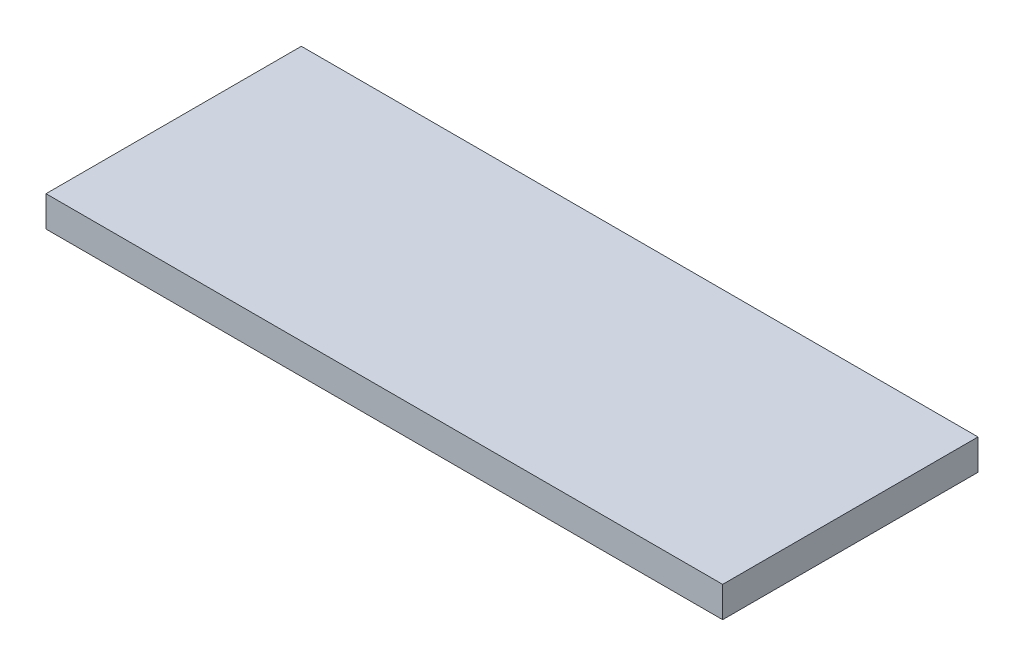
ISO-10303-21;
HEADER;
FILE_DESCRIPTION(('STEP AP214'),'2;1');
FILE_NAME('part.step','',(''),(''),'','','');
FILE_SCHEMA(('AUTOMOTIVE_DESIGN { 1 0 10303 214 1 1 1 1 }'));
ENDSEC;
DATA;
#1=APPLICATION_CONTEXT('core data for automotive mechanical design processes');
#2=APPLICATION_PROTOCOL_DEFINITION('international standard','automotive_design',2000,#1);
#3=PRODUCT_CONTEXT('',#1,'mechanical');
#4=PRODUCT('Part','Part','',(#3));
#5=PRODUCT_RELATED_PRODUCT_CATEGORY('part','',(#4));
#6=PRODUCT_DEFINITION_FORMATION('','',#4);
#7=PRODUCT_DEFINITION_CONTEXT('part definition',#1,'design');
#8=PRODUCT_DEFINITION('design','',#6,#7);
#9=PRODUCT_DEFINITION_SHAPE('','',#8);
#10=(LENGTH_UNIT() NAMED_UNIT(*) SI_UNIT(.MILLI.,.METRE.));
#11=(NAMED_UNIT(*) PLANE_ANGLE_UNIT() SI_UNIT($,.RADIAN.));
#12=(NAMED_UNIT(*) SI_UNIT($,.STERADIAN.) SOLID_ANGLE_UNIT());
#13=UNCERTAINTY_MEASURE_WITH_UNIT(LENGTH_MEASURE(1.E-05),#10,'distance_accuracy_value','');
#14=(GEOMETRIC_REPRESENTATION_CONTEXT(3) GLOBAL_UNCERTAINTY_ASSIGNED_CONTEXT((#13)) GLOBAL_UNIT_ASSIGNED_CONTEXT((#10,
#11,#12)) REPRESENTATION_CONTEXT('',''));
#15=CARTESIAN_POINT('',(0.,0.,0.));
#16=DIRECTION('',(0.,0.,1.));
#17=DIRECTION('',(1.,0.,0.));
#18=AXIS2_PLACEMENT_3D('',#15,#16,#17);
#19=CARTESIAN_POINT('',(66.25,6.,-25.));
#20=DIRECTION('',(-1.,0.,0.));
#21=DIRECTION('',(0.,0.,1.));
#22=AXIS2_PLACEMENT_3D('',#19,#20,#21);
#23=PLANE('',#22);
#24=DIRECTION('',(0.,0.,-1.));
#25=VECTOR('',#24,1.);
#26=CARTESIAN_POINT('',(66.25,0.,-25.));
#27=LINE('',#26,#25);
#28=CARTESIAN_POINT('',(66.25,0.,25.));
#29=VERTEX_POINT('',#28);
#30=CARTESIAN_POINT('',(66.25,0.,-25.));
#31=VERTEX_POINT('',#30);
#32=EDGE_CURVE('E96',#29,#31,#27,.T.);
#33=ORIENTED_EDGE('',*,*,#32,.T.);
#34=DIRECTION('',(0.,-1.,0.));
#35=VECTOR('',#34,1.);
#36=CARTESIAN_POINT('',(66.25,6.,-25.));
#37=LINE('',#36,#35);
#38=CARTESIAN_POINT('',(66.25,6.,-25.));
#39=VERTEX_POINT('',#38);
#40=EDGE_CURVE('E11',#39,#31,#37,.T.);
#41=ORIENTED_EDGE('',*,*,#40,.F.);
#42=DIRECTION('',(0.,0.,-1.));
#43=VECTOR('',#42,1.);
#44=CARTESIAN_POINT('',(66.25,6.,-25.));
#45=LINE('',#44,#43);
#46=CARTESIAN_POINT('',(66.25,6.,25.));
#47=VERTEX_POINT('',#46);
#48=EDGE_CURVE('E84',#47,#39,#45,.T.);
#49=ORIENTED_EDGE('',*,*,#48,.F.);
#50=DIRECTION('',(0.,-1.,0.));
#51=VECTOR('',#50,1.);
#52=CARTESIAN_POINT('',(66.25,6.,25.));
#53=LINE('',#52,#51);
#54=EDGE_CURVE('E92',#47,#29,#53,.T.);
#55=ORIENTED_EDGE('',*,*,#54,.T.);
#56=EDGE_LOOP('',(#33,#41,#49,#55));
#57=FACE_BOUND('',#56,.T.);
#58=ADVANCED_FACE('F33',(#57),#23,.F.);
#59=CARTESIAN_POINT('',(-66.25,6.,-25.));
#60=DIRECTION('',(0.,0.,1.));
#61=DIRECTION('',(1.,0.,0.));
#62=AXIS2_PLACEMENT_3D('',#59,#60,#61);
#63=PLANE('',#62);
#64=DIRECTION('',(-1.,0.,0.));
#65=VECTOR('',#64,1.);
#66=CARTESIAN_POINT('',(-66.25,0.,-25.));
#67=LINE('',#66,#65);
#68=CARTESIAN_POINT('',(-66.25,0.,-25.));
#69=VERTEX_POINT('',#68);
#70=EDGE_CURVE('E88',#31,#69,#67,.T.);
#71=ORIENTED_EDGE('',*,*,#70,.T.);
#72=DIRECTION('',(0.,-1.,0.));
#73=VECTOR('',#72,1.);
#74=CARTESIAN_POINT('',(-66.25,6.,-25.));
#75=LINE('',#74,#73);
#76=CARTESIAN_POINT('',(-66.25,6.,-25.));
#77=VERTEX_POINT('',#76);
#78=EDGE_CURVE('E41',#77,#69,#75,.T.);
#79=ORIENTED_EDGE('',*,*,#78,.F.);
#80=DIRECTION('',(-1.,0.,0.));
#81=VECTOR('',#80,1.);
#82=CARTESIAN_POINT('',(-66.25,6.,-25.));
#83=LINE('',#82,#81);
#84=EDGE_CURVE('E79',#39,#77,#83,.T.);
#85=ORIENTED_EDGE('',*,*,#84,.F.);
#86=ORIENTED_EDGE('',*,*,#40,.T.);
#87=EDGE_LOOP('',(#71,#79,#85,#86));
#88=FACE_BOUND('',#87,.T.);
#89=ADVANCED_FACE('F87',(#88),#63,.F.);
#90=CARTESIAN_POINT('',(-66.25,6.,-25.));
#91=DIRECTION('',(1.,0.,0.));
#92=DIRECTION('',(0.,0.,-1.));
#93=AXIS2_PLACEMENT_3D('',#90,#91,#92);
#94=PLANE('',#93);
#95=DIRECTION('',(0.,0.,1.));
#96=VECTOR('',#95,1.);
#97=CARTESIAN_POINT('',(-66.25,0.,-25.));
#98=LINE('',#97,#96);
#99=CARTESIAN_POINT('',(-66.25,0.,25.));
#100=VERTEX_POINT('',#99);
#101=EDGE_CURVE('E66',#69,#100,#98,.T.);
#102=ORIENTED_EDGE('',*,*,#101,.T.);
#103=DIRECTION('',(0.,-1.,0.));
#104=VECTOR('',#103,1.);
#105=CARTESIAN_POINT('',(-66.25,6.,25.));
#106=LINE('',#105,#104);
#107=CARTESIAN_POINT('',(-66.25,6.,25.));
#108=VERTEX_POINT('',#107);
#109=EDGE_CURVE('E89',#108,#100,#106,.T.);
#110=ORIENTED_EDGE('',*,*,#109,.F.);
#111=DIRECTION('',(0.,0.,1.));
#112=VECTOR('',#111,1.);
#113=CARTESIAN_POINT('',(-66.25,6.,-25.));
#114=LINE('',#113,#112);
#115=EDGE_CURVE('E82',#77,#108,#114,.T.);
#116=ORIENTED_EDGE('',*,*,#115,.F.);
#117=ORIENTED_EDGE('',*,*,#78,.T.);
#118=EDGE_LOOP('',(#102,#110,#116,#117));
#119=FACE_BOUND('',#118,.T.);
#120=ADVANCED_FACE('F90',(#119),#94,.F.);
#121=CARTESIAN_POINT('',(-66.25,6.,25.));
#122=DIRECTION('',(0.,0.,-1.));
#123=DIRECTION('',(-1.,0.,0.));
#124=AXIS2_PLACEMENT_3D('',#121,#122,#123);
#125=PLANE('',#124);
#126=DIRECTION('',(1.,0.,0.));
#127=VECTOR('',#126,1.);
#128=CARTESIAN_POINT('',(-66.25,0.,25.));
#129=LINE('',#128,#127);
#130=EDGE_CURVE('E72',#100,#29,#129,.T.);
#131=ORIENTED_EDGE('',*,*,#130,.T.);
#132=ORIENTED_EDGE('',*,*,#54,.F.);
#133=DIRECTION('',(1.,0.,0.));
#134=VECTOR('',#133,1.);
#135=CARTESIAN_POINT('',(-66.25,6.,25.));
#136=LINE('',#135,#134);
#137=EDGE_CURVE('E49',#108,#47,#136,.T.);
#138=ORIENTED_EDGE('',*,*,#137,.F.);
#139=ORIENTED_EDGE('',*,*,#109,.T.);
#140=EDGE_LOOP('',(#131,#132,#138,#139));
#141=FACE_BOUND('',#140,.T.);
#142=ADVANCED_FACE('F103',(#141),#125,.F.);
#143=CARTESIAN_POINT('',(0.,6.,0.));
#144=DIRECTION('',(0.,1.,0.));
#145=DIRECTION('',(0.,0.,1.));
#146=AXIS2_PLACEMENT_3D('',#143,#144,#145);
#147=PLANE('',#146);
#148=ORIENTED_EDGE('',*,*,#48,.T.);
#149=ORIENTED_EDGE('',*,*,#84,.T.);
#150=ORIENTED_EDGE('',*,*,#115,.T.);
#151=ORIENTED_EDGE('',*,*,#137,.T.);
#152=EDGE_LOOP('',(#148,#149,#150,#151));
#153=FACE_BOUND('',#152,.T.);
#154=ADVANCED_FACE('F80',(#153),#147,.T.);
#155=CARTESIAN_POINT('',(0.,0.,0.));
#156=DIRECTION('',(0.,1.,0.));
#157=DIRECTION('',(0.,0.,1.));
#158=AXIS2_PLACEMENT_3D('',#155,#156,#157);
#159=PLANE('',#158);
#160=ORIENTED_EDGE('',*,*,#32,.F.);
#161=ORIENTED_EDGE('',*,*,#130,.F.);
#162=ORIENTED_EDGE('',*,*,#101,.F.);
#163=ORIENTED_EDGE('',*,*,#70,.F.);
#164=EDGE_LOOP('',(#160,#161,#162,#163));
#165=FACE_BOUND('',#164,.T.);
#166=ADVANCED_FACE('F106',(#165),#159,.F.);
#167=CLOSED_SHELL('',(#58,#89,#120,#142,#154,#166));
#168=MANIFOLD_SOLID_BREP('B2',#167);
#169=ADVANCED_BREP_SHAPE_REPRESENTATION('',(#18,#168),#14);
#170=SHAPE_DEFINITION_REPRESENTATION(#9,#169);
ENDSEC;
END-ISO-10303-21;
